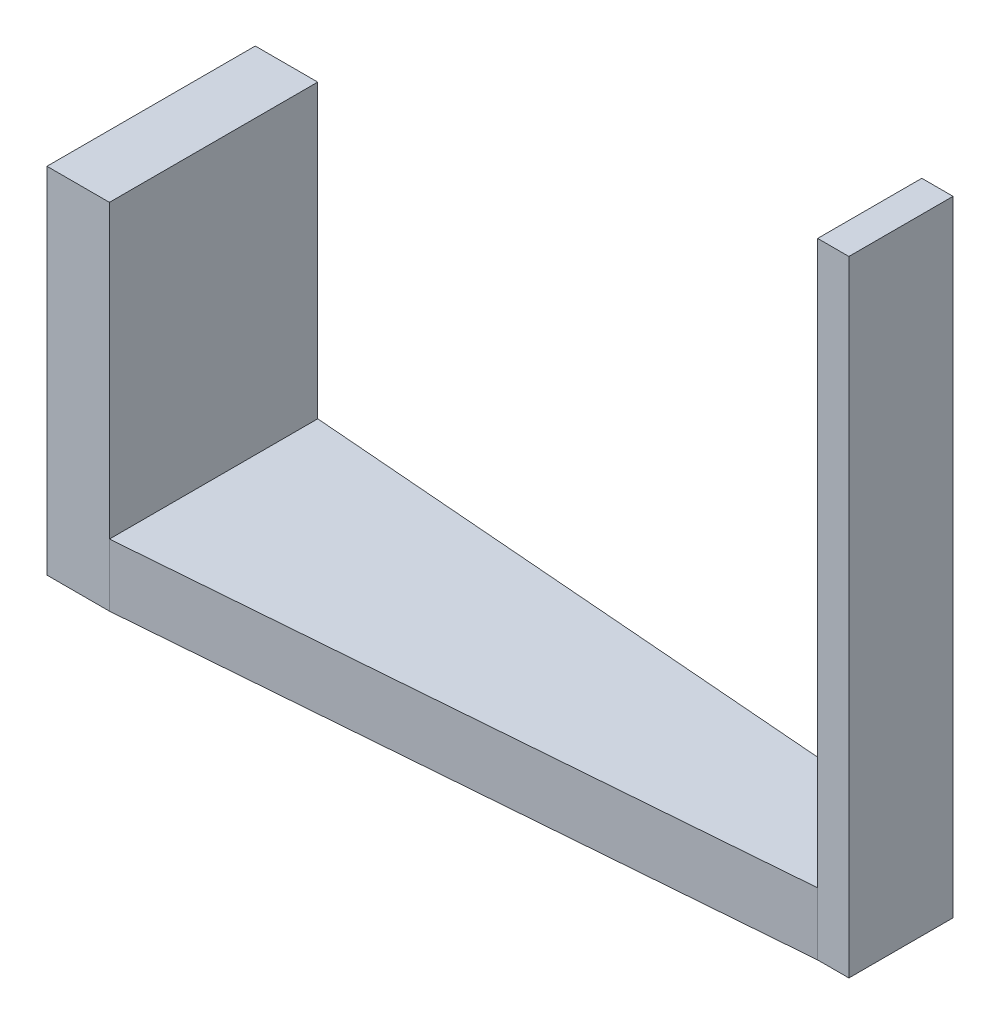
ISO-10303-21;
HEADER;
FILE_DESCRIPTION(('STEP AP214'),'2;1');
FILE_NAME('part.step','',(''),(''),'','','');
FILE_SCHEMA(('AUTOMOTIVE_DESIGN { 1 0 10303 214 1 1 1 1 }'));
ENDSEC;
DATA;
#1=APPLICATION_CONTEXT('core data for automotive mechanical design processes');
#2=APPLICATION_PROTOCOL_DEFINITION('international standard','automotive_design',2000,#1);
#3=PRODUCT_CONTEXT('',#1,'mechanical');
#4=PRODUCT('Part','Part','',(#3));
#5=PRODUCT_RELATED_PRODUCT_CATEGORY('part','',(#4));
#6=PRODUCT_DEFINITION_FORMATION('','',#4);
#7=PRODUCT_DEFINITION_CONTEXT('part definition',#1,'design');
#8=PRODUCT_DEFINITION('design','',#6,#7);
#9=PRODUCT_DEFINITION_SHAPE('','',#8);
#10=(LENGTH_UNIT() NAMED_UNIT(*) SI_UNIT(.MILLI.,.METRE.));
#11=(NAMED_UNIT(*) PLANE_ANGLE_UNIT() SI_UNIT($,.RADIAN.));
#12=(NAMED_UNIT(*) SI_UNIT($,.STERADIAN.) SOLID_ANGLE_UNIT());
#13=UNCERTAINTY_MEASURE_WITH_UNIT(LENGTH_MEASURE(1.E-05),#10,'distance_accuracy_value','');
#14=(GEOMETRIC_REPRESENTATION_CONTEXT(3) GLOBAL_UNCERTAINTY_ASSIGNED_CONTEXT((#13)) GLOBAL_UNIT_ASSIGNED_CONTEXT((#10,
#11,#12)) REPRESENTATION_CONTEXT('',''));
#15=CARTESIAN_POINT('',(0.,0.,0.));
#16=DIRECTION('',(0.,0.,1.));
#17=DIRECTION('',(1.,0.,0.));
#18=AXIS2_PLACEMENT_3D('',#15,#16,#17);
#19=CARTESIAN_POINT('',(0.,3.,0.));
#20=DIRECTION('',(0.,-1.,0.));
#21=DIRECTION('',(0.,0.,-1.));
#22=AXIS2_PLACEMENT_3D('',#19,#20,#21);
#23=PLANE('',#22);
#24=DIRECTION('',(0.,0.,1.));
#25=VECTOR('',#24,1.);
#26=CARTESIAN_POINT('',(16.5,3.,2.5));
#27=LINE('',#26,#25);
#28=CARTESIAN_POINT('',(16.5,3.,-2.5));
#29=VERTEX_POINT('',#28);
#30=CARTESIAN_POINT('',(16.5,3.,2.5));
#31=VERTEX_POINT('',#30);
#32=EDGE_CURVE('E167',#29,#31,#27,.T.);
#33=ORIENTED_EDGE('',*,*,#32,.F.);
#34=DIRECTION('',(-0.996865392576337,0.,-0.079116300998122));
#35=VECTOR('',#34,1.);
#36=CARTESIAN_POINT('',(16.5,3.,-2.5));
#37=LINE('',#36,#35);
#38=CARTESIAN_POINT('',(-15.,3.,-5.));
#39=VERTEX_POINT('',#38);
#40=EDGE_CURVE('E103',#29,#39,#37,.T.);
#41=ORIENTED_EDGE('',*,*,#40,.T.);
#42=DIRECTION('',(0.,0.,-1.));
#43=VECTOR('',#42,1.);
#44=CARTESIAN_POINT('',(-15.,3.,-5.));
#45=LINE('',#44,#43);
#46=CARTESIAN_POINT('',(-15.,3.,5.));
#47=VERTEX_POINT('',#46);
#48=EDGE_CURVE('E183',#47,#39,#45,.T.);
#49=ORIENTED_EDGE('',*,*,#48,.F.);
#50=DIRECTION('',(0.996865392576337,0.,-0.0791163009981219));
#51=VECTOR('',#50,1.);
#52=CARTESIAN_POINT('',(16.5,3.,2.5));
#53=LINE('',#52,#51);
#54=EDGE_CURVE('E50',#47,#31,#53,.T.);
#55=ORIENTED_EDGE('',*,*,#54,.T.);
#56=EDGE_LOOP('',(#33,#41,#49,#55));
#57=FACE_BOUND('',#56,.T.);
#58=ADVANCED_FACE('F33',(#57),#23,.F.);
#59=CARTESIAN_POINT('',(-18.,3.,5.));
#60=DIRECTION('',(1.,0.,0.));
#61=DIRECTION('',(0.,0.,-1.));
#62=AXIS2_PLACEMENT_3D('',#59,#60,#61);
#63=PLANE('',#62);
#64=DIRECTION('',(0.,0.,1.));
#65=VECTOR('',#64,1.);
#66=CARTESIAN_POINT('',(-18.,0.,5.));
#67=LINE('',#66,#65);
#68=CARTESIAN_POINT('',(-18.,0.,-5.));
#69=VERTEX_POINT('',#68);
#70=CARTESIAN_POINT('',(-18.,0.,5.));
#71=VERTEX_POINT('',#70);
#72=EDGE_CURVE('E100',#69,#71,#67,.T.);
#73=ORIENTED_EDGE('',*,*,#72,.T.);
#74=DIRECTION('',(0.,-1.,0.));
#75=VECTOR('',#74,1.);
#76=CARTESIAN_POINT('',(-18.,3.,5.));
#77=LINE('',#76,#75);
#78=CARTESIAN_POINT('',(-18.,17.,5.));
#79=VERTEX_POINT('',#78);
#80=EDGE_CURVE('E11',#79,#71,#77,.T.);
#81=ORIENTED_EDGE('',*,*,#80,.F.);
#82=DIRECTION('',(0.,0.,1.));
#83=VECTOR('',#82,1.);
#84=CARTESIAN_POINT('',(-18.,17.,-5.));
#85=LINE('',#84,#83);
#86=CARTESIAN_POINT('',(-18.,17.,-5.));
#87=VERTEX_POINT('',#86);
#88=EDGE_CURVE('E102',#87,#79,#85,.T.);
#89=ORIENTED_EDGE('',*,*,#88,.F.);
#90=DIRECTION('',(0.,-1.,0.));
#91=VECTOR('',#90,1.);
#92=CARTESIAN_POINT('',(-18.,3.,-5.));
#93=LINE('',#92,#91);
#94=EDGE_CURVE('E89',#87,#69,#93,.T.);
#95=ORIENTED_EDGE('',*,*,#94,.T.);
#96=EDGE_LOOP('',(#73,#81,#89,#95));
#97=FACE_BOUND('',#96,.T.);
#98=ADVANCED_FACE('F35',(#97),#63,.F.);
#99=CARTESIAN_POINT('',(-18.,3.,5.));
#100=DIRECTION('',(0.,0.,-1.));
#101=DIRECTION('',(-1.,0.,0.));
#102=AXIS2_PLACEMENT_3D('',#99,#100,#101);
#103=PLANE('',#102);
#104=DIRECTION('',(1.,0.,0.));
#105=VECTOR('',#104,1.);
#106=CARTESIAN_POINT('',(-18.,0.,5.));
#107=LINE('',#106,#105);
#108=CARTESIAN_POINT('',(-15.,0.,5.));
#109=VERTEX_POINT('',#108);
#110=EDGE_CURVE('E107',#71,#109,#107,.T.);
#111=ORIENTED_EDGE('',*,*,#110,.T.);
#112=DIRECTION('',(0.,-1.,0.));
#113=VECTOR('',#112,1.);
#114=CARTESIAN_POINT('',(-15.,3.,5.));
#115=LINE('',#114,#113);
#116=EDGE_CURVE('E42',#47,#109,#115,.T.);
#117=ORIENTED_EDGE('',*,*,#116,.F.);
#118=DIRECTION('',(0.,-1.,0.));
#119=VECTOR('',#118,1.);
#120=CARTESIAN_POINT('',(-15.,17.,5.));
#121=LINE('',#120,#119);
#122=CARTESIAN_POINT('',(-15.,17.,5.));
#123=VERTEX_POINT('',#122);
#124=EDGE_CURVE('E108',#123,#47,#121,.T.);
#125=ORIENTED_EDGE('',*,*,#124,.F.);
#126=DIRECTION('',(1.,0.,0.));
#127=VECTOR('',#126,1.);
#128=CARTESIAN_POINT('',(-18.,17.,5.));
#129=LINE('',#128,#127);
#130=EDGE_CURVE('E185',#79,#123,#129,.T.);
#131=ORIENTED_EDGE('',*,*,#130,.F.);
#132=ORIENTED_EDGE('',*,*,#80,.T.);
#133=EDGE_LOOP('',(#111,#117,#125,#131,#132));
#134=FACE_BOUND('',#133,.T.);
#135=ADVANCED_FACE('F238',(#134),#103,.F.);
#136=CARTESIAN_POINT('',(16.5,3.,2.5));
#137=DIRECTION('',(-0.0791163009981219,0.,-0.996865392576337));
#138=DIRECTION('',(-0.996865392576337,0.,0.0791163009981219));
#139=AXIS2_PLACEMENT_3D('',#136,#137,#138);
#140=PLANE('',#139);
#141=DIRECTION('',(0.996865392576337,0.,-0.0791163009981219));
#142=VECTOR('',#141,1.);
#143=CARTESIAN_POINT('',(16.5,0.,2.5));
#144=LINE('',#143,#142);
#145=CARTESIAN_POINT('',(16.5,0.,2.5));
#146=VERTEX_POINT('',#145);
#147=EDGE_CURVE('E110',#109,#146,#144,.T.);
#148=ORIENTED_EDGE('',*,*,#147,.T.);
#149=DIRECTION('',(0.,-1.,0.));
#150=VECTOR('',#149,1.);
#151=CARTESIAN_POINT('',(16.5,3.,2.5));
#152=LINE('',#151,#150);
#153=EDGE_CURVE('E135',#31,#146,#152,.T.);
#154=ORIENTED_EDGE('',*,*,#153,.F.);
#155=ORIENTED_EDGE('',*,*,#54,.F.);
#156=ORIENTED_EDGE('',*,*,#116,.T.);
#157=EDGE_LOOP('',(#148,#154,#155,#156));
#158=FACE_BOUND('',#157,.T.);
#159=ADVANCED_FACE('F140',(#158),#140,.F.);
#160=CARTESIAN_POINT('',(18.,3.,2.5));
#161=DIRECTION('',(0.,0.,-1.));
#162=DIRECTION('',(-1.,0.,0.));
#163=AXIS2_PLACEMENT_3D('',#160,#161,#162);
#164=PLANE('',#163);
#165=DIRECTION('',(1.,0.,0.));
#166=VECTOR('',#165,1.);
#167=CARTESIAN_POINT('',(18.,0.,2.5));
#168=LINE('',#167,#166);
#169=CARTESIAN_POINT('',(18.,0.,2.5));
#170=VERTEX_POINT('',#169);
#171=EDGE_CURVE('E119',#146,#170,#168,.T.);
#172=ORIENTED_EDGE('',*,*,#171,.T.);
#173=DIRECTION('',(0.,-1.,0.));
#174=VECTOR('',#173,1.);
#175=CARTESIAN_POINT('',(18.,3.,2.5));
#176=LINE('',#175,#174);
#177=CARTESIAN_POINT('',(18.,30.,2.5));
#178=VERTEX_POINT('',#177);
#179=EDGE_CURVE('E132',#178,#170,#176,.T.);
#180=ORIENTED_EDGE('',*,*,#179,.F.);
#181=DIRECTION('',(1.,0.,0.));
#182=VECTOR('',#181,1.);
#183=CARTESIAN_POINT('',(18.,30.,2.5));
#184=LINE('',#183,#182);
#185=CARTESIAN_POINT('',(16.5,30.,2.5));
#186=VERTEX_POINT('',#185);
#187=EDGE_CURVE('E176',#186,#178,#184,.T.);
#188=ORIENTED_EDGE('',*,*,#187,.F.);
#189=DIRECTION('',(0.,-1.,0.));
#190=VECTOR('',#189,1.);
#191=CARTESIAN_POINT('',(16.5,30.,2.5));
#192=LINE('',#191,#190);
#193=EDGE_CURVE('E177',#186,#31,#192,.T.);
#194=ORIENTED_EDGE('',*,*,#193,.T.);
#195=ORIENTED_EDGE('',*,*,#153,.T.);
#196=EDGE_LOOP('',(#172,#180,#188,#194,#195));
#197=FACE_BOUND('',#196,.T.);
#198=ADVANCED_FACE('F148',(#197),#164,.F.);
#199=CARTESIAN_POINT('',(18.,3.,2.5));
#200=DIRECTION('',(-1.,0.,0.));
#201=DIRECTION('',(0.,0.,1.));
#202=AXIS2_PLACEMENT_3D('',#199,#200,#201);
#203=PLANE('',#202);
#204=DIRECTION('',(0.,0.,-1.));
#205=VECTOR('',#204,1.);
#206=CARTESIAN_POINT('',(18.,0.,2.5));
#207=LINE('',#206,#205);
#208=CARTESIAN_POINT('',(18.,0.,-2.5));
#209=VERTEX_POINT('',#208);
#210=EDGE_CURVE('E121',#170,#209,#207,.T.);
#211=ORIENTED_EDGE('',*,*,#210,.T.);
#212=DIRECTION('',(0.,-1.,0.));
#213=VECTOR('',#212,1.);
#214=CARTESIAN_POINT('',(18.,3.,-2.5));
#215=LINE('',#214,#213);
#216=CARTESIAN_POINT('',(18.,30.,-2.5));
#217=VERTEX_POINT('',#216);
#218=EDGE_CURVE('E129',#217,#209,#215,.T.);
#219=ORIENTED_EDGE('',*,*,#218,.F.);
#220=DIRECTION('',(0.,0.,-1.));
#221=VECTOR('',#220,1.);
#222=CARTESIAN_POINT('',(18.,30.,2.5));
#223=LINE('',#222,#221);
#224=EDGE_CURVE('E158',#178,#217,#223,.T.);
#225=ORIENTED_EDGE('',*,*,#224,.F.);
#226=ORIENTED_EDGE('',*,*,#179,.T.);
#227=EDGE_LOOP('',(#211,#219,#225,#226));
#228=FACE_BOUND('',#227,.T.);
#229=ADVANCED_FACE('F155',(#228),#203,.F.);
#230=CARTESIAN_POINT('',(18.,3.,-2.5));
#231=DIRECTION('',(0.,0.,1.));
#232=DIRECTION('',(1.,0.,0.));
#233=AXIS2_PLACEMENT_3D('',#230,#231,#232);
#234=PLANE('',#233);
#235=DIRECTION('',(-1.,0.,0.));
#236=VECTOR('',#235,1.);
#237=CARTESIAN_POINT('',(18.,0.,-2.5));
#238=LINE('',#237,#236);
#239=CARTESIAN_POINT('',(16.5,0.,-2.5));
#240=VERTEX_POINT('',#239);
#241=EDGE_CURVE('E123',#209,#240,#238,.T.);
#242=ORIENTED_EDGE('',*,*,#241,.T.);
#243=DIRECTION('',(0.,-1.,0.));
#244=VECTOR('',#243,1.);
#245=CARTESIAN_POINT('',(16.5,3.,-2.5));
#246=LINE('',#245,#244);
#247=EDGE_CURVE('E127',#29,#240,#246,.T.);
#248=ORIENTED_EDGE('',*,*,#247,.F.);
#249=DIRECTION('',(0.,-1.,0.));
#250=VECTOR('',#249,1.);
#251=CARTESIAN_POINT('',(16.5,30.,-2.5));
#252=LINE('',#251,#250);
#253=CARTESIAN_POINT('',(16.5,30.,-2.5));
#254=VERTEX_POINT('',#253);
#255=EDGE_CURVE('E180',#254,#29,#252,.T.);
#256=ORIENTED_EDGE('',*,*,#255,.F.);
#257=DIRECTION('',(-1.,0.,0.));
#258=VECTOR('',#257,1.);
#259=CARTESIAN_POINT('',(18.,30.,-2.5));
#260=LINE('',#259,#258);
#261=EDGE_CURVE('E166',#217,#254,#260,.T.);
#262=ORIENTED_EDGE('',*,*,#261,.F.);
#263=ORIENTED_EDGE('',*,*,#218,.T.);
#264=EDGE_LOOP('',(#242,#248,#256,#262,#263));
#265=FACE_BOUND('',#264,.T.);
#266=ADVANCED_FACE('F222',(#265),#234,.F.);
#267=CARTESIAN_POINT('',(16.5,3.,-2.5));
#268=DIRECTION('',(-0.079116300998122,0.,0.996865392576337));
#269=DIRECTION('',(0.996865392576337,0.,0.079116300998122));
#270=AXIS2_PLACEMENT_3D('',#267,#268,#269);
#271=PLANE('',#270);
#272=DIRECTION('',(-0.996865392576337,0.,-0.079116300998122));
#273=VECTOR('',#272,1.);
#274=CARTESIAN_POINT('',(16.5,0.,-2.5));
#275=LINE('',#274,#273);
#276=CARTESIAN_POINT('',(-15.,0.,-5.));
#277=VERTEX_POINT('',#276);
#278=EDGE_CURVE('E79',#240,#277,#275,.T.);
#279=ORIENTED_EDGE('',*,*,#278,.T.);
#280=DIRECTION('',(0.,-1.,0.));
#281=VECTOR('',#280,1.);
#282=CARTESIAN_POINT('',(-15.,3.,-5.));
#283=LINE('',#282,#281);
#284=EDGE_CURVE('E92',#39,#277,#283,.T.);
#285=ORIENTED_EDGE('',*,*,#284,.F.);
#286=ORIENTED_EDGE('',*,*,#40,.F.);
#287=ORIENTED_EDGE('',*,*,#247,.T.);
#288=EDGE_LOOP('',(#279,#285,#286,#287));
#289=FACE_BOUND('',#288,.T.);
#290=ADVANCED_FACE('F245',(#289),#271,.F.);
#291=CARTESIAN_POINT('',(-18.,3.,-5.));
#292=DIRECTION('',(0.,0.,1.));
#293=DIRECTION('',(1.,0.,0.));
#294=AXIS2_PLACEMENT_3D('',#291,#292,#293);
#295=PLANE('',#294);
#296=DIRECTION('',(-1.,0.,0.));
#297=VECTOR('',#296,1.);
#298=CARTESIAN_POINT('',(-18.,0.,-5.));
#299=LINE('',#298,#297);
#300=EDGE_CURVE('E85',#277,#69,#299,.T.);
#301=ORIENTED_EDGE('',*,*,#300,.T.);
#302=ORIENTED_EDGE('',*,*,#94,.F.);
#303=DIRECTION('',(-1.,0.,0.));
#304=VECTOR('',#303,1.);
#305=CARTESIAN_POINT('',(-18.,17.,-5.));
#306=LINE('',#305,#304);
#307=CARTESIAN_POINT('',(-15.,17.,-5.));
#308=VERTEX_POINT('',#307);
#309=EDGE_CURVE('E191',#308,#87,#306,.T.);
#310=ORIENTED_EDGE('',*,*,#309,.F.);
#311=DIRECTION('',(0.,-1.,0.));
#312=VECTOR('',#311,1.);
#313=CARTESIAN_POINT('',(-15.,17.,-5.));
#314=LINE('',#313,#312);
#315=EDGE_CURVE('E113',#308,#39,#314,.T.);
#316=ORIENTED_EDGE('',*,*,#315,.T.);
#317=ORIENTED_EDGE('',*,*,#284,.T.);
#318=EDGE_LOOP('',(#301,#302,#310,#316,#317));
#319=FACE_BOUND('',#318,.T.);
#320=ADVANCED_FACE('F87',(#319),#295,.F.);
#321=CARTESIAN_POINT('',(0.,0.,0.));
#322=DIRECTION('',(0.,-1.,0.));
#323=DIRECTION('',(0.,0.,-1.));
#324=AXIS2_PLACEMENT_3D('',#321,#322,#323);
#325=PLANE('',#324);
#326=ORIENTED_EDGE('',*,*,#72,.F.);
#327=ORIENTED_EDGE('',*,*,#300,.F.);
#328=ORIENTED_EDGE('',*,*,#278,.F.);
#329=ORIENTED_EDGE('',*,*,#241,.F.);
#330=ORIENTED_EDGE('',*,*,#210,.F.);
#331=ORIENTED_EDGE('',*,*,#171,.F.);
#332=ORIENTED_EDGE('',*,*,#147,.F.);
#333=ORIENTED_EDGE('',*,*,#110,.F.);
#334=EDGE_LOOP('',(#326,#327,#328,#329,#330,#331,#332,#333));
#335=FACE_BOUND('',#334,.T.);
#336=ADVANCED_FACE('F105',(#335),#325,.T.);
#337=CARTESIAN_POINT('',(-15.,17.,-5.));
#338=DIRECTION('',(-1.,0.,0.));
#339=DIRECTION('',(0.,0.,1.));
#340=AXIS2_PLACEMENT_3D('',#337,#338,#339);
#341=PLANE('',#340);
#342=ORIENTED_EDGE('',*,*,#48,.T.);
#343=ORIENTED_EDGE('',*,*,#315,.F.);
#344=DIRECTION('',(0.,0.,-1.));
#345=VECTOR('',#344,1.);
#346=CARTESIAN_POINT('',(-15.,17.,-5.));
#347=LINE('',#346,#345);
#348=EDGE_CURVE('E188',#123,#308,#347,.T.);
#349=ORIENTED_EDGE('',*,*,#348,.F.);
#350=ORIENTED_EDGE('',*,*,#124,.T.);
#351=EDGE_LOOP('',(#342,#343,#349,#350));
#352=FACE_BOUND('',#351,.T.);
#353=ADVANCED_FACE('F202',(#352),#341,.F.);
#354=CARTESIAN_POINT('',(0.,17.,0.));
#355=DIRECTION('',(0.,1.,0.));
#356=DIRECTION('',(0.,0.,1.));
#357=AXIS2_PLACEMENT_3D('',#354,#355,#356);
#358=PLANE('',#357);
#359=ORIENTED_EDGE('',*,*,#88,.T.);
#360=ORIENTED_EDGE('',*,*,#130,.T.);
#361=ORIENTED_EDGE('',*,*,#348,.T.);
#362=ORIENTED_EDGE('',*,*,#309,.T.);
#363=EDGE_LOOP('',(#359,#360,#361,#362));
#364=FACE_BOUND('',#363,.T.);
#365=ADVANCED_FACE('F208',(#364),#358,.T.);
#366=CARTESIAN_POINT('',(16.5,30.,2.5));
#367=DIRECTION('',(1.,0.,0.));
#368=DIRECTION('',(0.,0.,-1.));
#369=AXIS2_PLACEMENT_3D('',#366,#367,#368);
#370=PLANE('',#369);
#371=ORIENTED_EDGE('',*,*,#32,.T.);
#372=ORIENTED_EDGE('',*,*,#193,.F.);
#373=DIRECTION('',(0.,0.,1.));
#374=VECTOR('',#373,1.);
#375=CARTESIAN_POINT('',(16.5,30.,2.5));
#376=LINE('',#375,#374);
#377=EDGE_CURVE('E169',#254,#186,#376,.T.);
#378=ORIENTED_EDGE('',*,*,#377,.F.);
#379=ORIENTED_EDGE('',*,*,#255,.T.);
#380=EDGE_LOOP('',(#371,#372,#378,#379));
#381=FACE_BOUND('',#380,.T.);
#382=ADVANCED_FACE('F224',(#381),#370,.F.);
#383=CARTESIAN_POINT('',(0.,30.,0.));
#384=DIRECTION('',(0.,1.,0.));
#385=DIRECTION('',(0.,0.,1.));
#386=AXIS2_PLACEMENT_3D('',#383,#384,#385);
#387=PLANE('',#386);
#388=ORIENTED_EDGE('',*,*,#224,.T.);
#389=ORIENTED_EDGE('',*,*,#261,.T.);
#390=ORIENTED_EDGE('',*,*,#377,.T.);
#391=ORIENTED_EDGE('',*,*,#187,.T.);
#392=EDGE_LOOP('',(#388,#389,#390,#391));
#393=FACE_BOUND('',#392,.T.);
#394=ADVANCED_FACE('F218',(#393),#387,.T.);
#395=CLOSED_SHELL('',(#58,#98,#135,#159,#198,#229,#266,#290,#320,#336,#353,#365,#382,#394));
#396=MANIFOLD_SOLID_BREP('B2',#395);
#397=ADVANCED_BREP_SHAPE_REPRESENTATION('',(#18,#396),#14);
#398=SHAPE_DEFINITION_REPRESENTATION(#9,#397);
ENDSEC;
END-ISO-10303-21;
